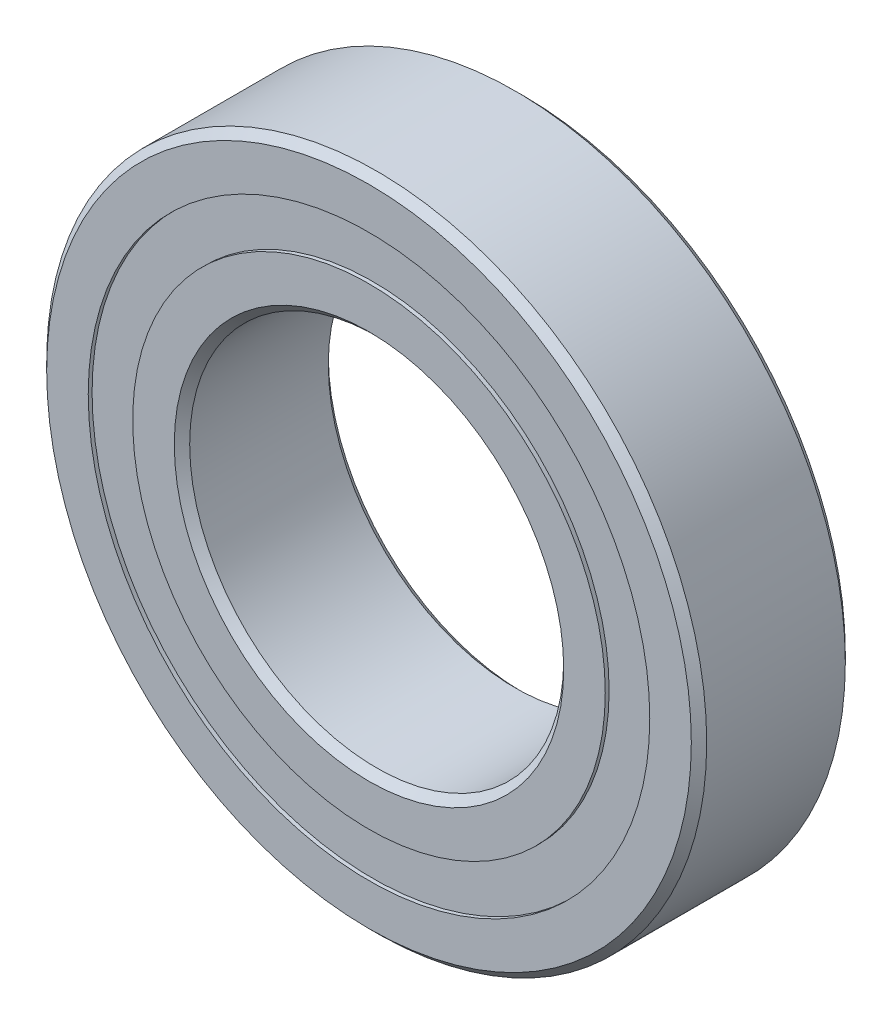
ISO-10303-21;
HEADER;
FILE_DESCRIPTION(('STEP AP214'),'2;1');
FILE_NAME('part.step','',(''),(''),'','','');
FILE_SCHEMA(('AUTOMOTIVE_DESIGN { 1 0 10303 214 1 1 1 1 }'));
ENDSEC;
DATA;
#1=APPLICATION_CONTEXT('core data for automotive mechanical design processes');
#2=APPLICATION_PROTOCOL_DEFINITION('international standard','automotive_design',2000,#1);
#3=PRODUCT_CONTEXT('',#1,'mechanical');
#4=PRODUCT('Part','Part','',(#3));
#5=PRODUCT_RELATED_PRODUCT_CATEGORY('part','',(#4));
#6=PRODUCT_DEFINITION_FORMATION('','',#4);
#7=PRODUCT_DEFINITION_CONTEXT('part definition',#1,'design');
#8=PRODUCT_DEFINITION('design','',#6,#7);
#9=PRODUCT_DEFINITION_SHAPE('','',#8);
#10=(LENGTH_UNIT() NAMED_UNIT(*) SI_UNIT(.MILLI.,.METRE.));
#11=(NAMED_UNIT(*) PLANE_ANGLE_UNIT() SI_UNIT($,.RADIAN.));
#12=(NAMED_UNIT(*) SI_UNIT($,.STERADIAN.) SOLID_ANGLE_UNIT());
#13=UNCERTAINTY_MEASURE_WITH_UNIT(LENGTH_MEASURE(1.E-05),#10,'distance_accuracy_value','');
#14=(GEOMETRIC_REPRESENTATION_CONTEXT(3) GLOBAL_UNCERTAINTY_ASSIGNED_CONTEXT((#13)) GLOBAL_UNIT_ASSIGNED_CONTEXT((#10,
#11,#12)) REPRESENTATION_CONTEXT('',''));
#15=CARTESIAN_POINT('',(0.,0.,0.));
#16=DIRECTION('',(0.,0.,1.));
#17=DIRECTION('',(1.,0.,0.));
#18=AXIS2_PLACEMENT_3D('',#15,#16,#17);
#19=CARTESIAN_POINT('',(-5.87499999999987,10.1757984944672,0.));
#20=DIRECTION('',(0.,0.,1.));
#21=DIRECTION('',(-0.499999999999989,0.866025403784445,0.));
#22=AXIS2_PLACEMENT_3D('',#19,#20,#21);
#23=SPHERICAL_SURFACE('',#22,1.85522286175012);
#24=CARTESIAN_POINT('',(-5.87499999999987,10.1757984944672,1.85522286175012));
#25=VERTEX_POINT('',#24);
#26=VERTEX_LOOP('',#25);
#27=FACE_BOUND('',#26,.T.);
#28=ADVANCED_FACE('F44',(#27),#23,.T.);
#29=CLOSED_SHELL('',(#28));
#30=MANIFOLD_SOLID_BREP('B2',#29);
#31=CARTESIAN_POINT('',(-10.1757984944671,5.87500000000012,0.));
#32=DIRECTION('',(0.,0.,1.));
#33=DIRECTION('',(-0.866025403784433,0.50000000000001,0.));
#34=AXIS2_PLACEMENT_3D('',#31,#32,#33);
#35=SPHERICAL_SURFACE('',#34,1.85522286175012);
#36=CARTESIAN_POINT('',(-10.1757984944671,5.87500000000012,1.85522286175012));
#37=VERTEX_POINT('',#36);
#38=VERTEX_LOOP('',#37);
#39=FACE_BOUND('',#38,.T.);
#40=ADVANCED_FACE('F67',(#39),#35,.T.);
#41=CLOSED_SHELL('',(#40));
#42=MANIFOLD_SOLID_BREP('B6',#41);
#43=CARTESIAN_POINT('',(-11.75,1.2307471719422E-13,0.));
#44=DIRECTION('',(0.,0.,1.));
#45=DIRECTION('',(-1.,0.,0.));
#46=AXIS2_PLACEMENT_3D('',#43,#44,#45);
#47=SPHERICAL_SURFACE('',#46,1.85522286175012);
#48=CARTESIAN_POINT('',(-11.75,1.2307471719422E-13,1.85522286175012));
#49=VERTEX_POINT('',#48);
#50=VERTEX_LOOP('',#49);
#51=FACE_BOUND('',#50,.T.);
#52=ADVANCED_FACE('F90',(#51),#47,.T.);
#53=CLOSED_SHELL('',(#52));
#54=MANIFOLD_SOLID_BREP('B40',#53);
#55=CARTESIAN_POINT('',(-10.1757984944672,-5.87499999999991,0.));
#56=DIRECTION('',(0.,0.,1.));
#57=DIRECTION('',(-0.866025403784443,-0.499999999999992,0.));
#58=AXIS2_PLACEMENT_3D('',#55,#56,#57);
#59=SPHERICAL_SURFACE('',#58,1.85522286175012);
#60=CARTESIAN_POINT('',(-10.1757984944672,-5.87499999999991,1.85522286175012));
#61=VERTEX_POINT('',#60);
#62=VERTEX_LOOP('',#61);
#63=FACE_BOUND('',#62,.T.);
#64=ADVANCED_FACE('F113',(#63),#59,.T.);
#65=CLOSED_SHELL('',(#64));
#66=MANIFOLD_SOLID_BREP('B63',#65);
#67=CARTESIAN_POINT('',(-5.87500000000009,-10.1757984944671,0.));
#68=DIRECTION('',(0.,0.,1.));
#69=DIRECTION('',(-0.500000000000007,-0.866025403784435,0.));
#70=AXIS2_PLACEMENT_3D('',#67,#68,#69);
#71=SPHERICAL_SURFACE('',#70,1.85522286175012);
#72=CARTESIAN_POINT('',(-5.87500000000009,-10.1757984944671,1.85522286175012));
#73=VERTEX_POINT('',#72);
#74=VERTEX_LOOP('',#73);
#75=FACE_BOUND('',#74,.T.);
#76=ADVANCED_FACE('F136',(#75),#71,.T.);
#77=CLOSED_SHELL('',(#76));
#78=MANIFOLD_SOLID_BREP('B86',#77);
#79=CARTESIAN_POINT('',(0.,-11.75,0.));
#80=DIRECTION('',(0.,0.,1.));
#81=DIRECTION('',(0.,-1.,0.));
#82=AXIS2_PLACEMENT_3D('',#79,#80,#81);
#83=SPHERICAL_SURFACE('',#82,1.85522286175012);
#84=CARTESIAN_POINT('',(0.,-11.75,1.85522286175012));
#85=VERTEX_POINT('',#84);
#86=VERTEX_LOOP('',#85);
#87=FACE_BOUND('',#86,.T.);
#88=ADVANCED_FACE('F159',(#87),#83,.T.);
#89=CLOSED_SHELL('',(#88));
#90=MANIFOLD_SOLID_BREP('B109',#89);
#91=CARTESIAN_POINT('',(5.87499999999994,-10.1757984944672,0.));
#92=DIRECTION('',(0.,0.,1.));
#93=DIRECTION('',(0.499999999999995,-0.866025403784442,0.));
#94=AXIS2_PLACEMENT_3D('',#91,#92,#93);
#95=SPHERICAL_SURFACE('',#94,1.85522286175012);
#96=CARTESIAN_POINT('',(5.87499999999994,-10.1757984944672,1.85522286175012));
#97=VERTEX_POINT('',#96);
#98=VERTEX_LOOP('',#97);
#99=FACE_BOUND('',#98,.T.);
#100=ADVANCED_FACE('F182',(#99),#95,.T.);
#101=CLOSED_SHELL('',(#100));
#102=MANIFOLD_SOLID_BREP('B132',#101);
#103=CARTESIAN_POINT('',(10.1757984944671,-5.87500000000005,0.));
#104=DIRECTION('',(0.,0.,1.));
#105=DIRECTION('',(0.866025403784436,-0.500000000000004,0.));
#106=AXIS2_PLACEMENT_3D('',#103,#104,#105);
#107=SPHERICAL_SURFACE('',#106,1.85522286175012);
#108=CARTESIAN_POINT('',(10.1757984944671,-5.87500000000005,1.85522286175012));
#109=VERTEX_POINT('',#108);
#110=VERTEX_LOOP('',#109);
#111=FACE_BOUND('',#110,.T.);
#112=ADVANCED_FACE('F205',(#111),#107,.T.);
#113=CLOSED_SHELL('',(#112));
#114=MANIFOLD_SOLID_BREP('B155',#113);
#115=CARTESIAN_POINT('',(11.75,0.,0.));
#116=DIRECTION('',(0.,0.,1.));
#117=DIRECTION('',(1.,0.,0.));
#118=AXIS2_PLACEMENT_3D('',#115,#116,#117);
#119=SPHERICAL_SURFACE('',#118,1.85522286175012);
#120=CARTESIAN_POINT('',(11.75,0.,1.85522286175012));
#121=VERTEX_POINT('',#120);
#122=VERTEX_LOOP('',#121);
#123=FACE_BOUND('',#122,.T.);
#124=ADVANCED_FACE('F228',(#123),#119,.T.);
#125=CLOSED_SHELL('',(#124));
#126=MANIFOLD_SOLID_BREP('B178',#125);
#127=CARTESIAN_POINT('',(10.1757984944672,5.87499999999998,0.));
#128=DIRECTION('',(0.,0.,1.));
#129=DIRECTION('',(0.86602540378444,0.499999999999998,0.));
#130=AXIS2_PLACEMENT_3D('',#127,#128,#129);
#131=SPHERICAL_SURFACE('',#130,1.85522286175012);
#132=CARTESIAN_POINT('',(10.1757984944672,5.87499999999998,1.85522286175012));
#133=VERTEX_POINT('',#132);
#134=VERTEX_LOOP('',#133);
#135=FACE_BOUND('',#134,.T.);
#136=ADVANCED_FACE('F251',(#135),#131,.T.);
#137=CLOSED_SHELL('',(#136));
#138=MANIFOLD_SOLID_BREP('B201',#137);
#139=CARTESIAN_POINT('',(5.87500000000001,10.1757984944671,0.));
#140=DIRECTION('',(0.,0.,1.));
#141=DIRECTION('',(0.500000000000001,0.866025403784438,0.));
#142=AXIS2_PLACEMENT_3D('',#139,#140,#141);
#143=SPHERICAL_SURFACE('',#142,1.85522286175012);
#144=CARTESIAN_POINT('',(5.87500000000001,10.1757984944671,1.85522286175012));
#145=VERTEX_POINT('',#144);
#146=VERTEX_LOOP('',#145);
#147=FACE_BOUND('',#146,.T.);
#148=ADVANCED_FACE('F274',(#147),#143,.T.);
#149=CLOSED_SHELL('',(#148));
#150=MANIFOLD_SOLID_BREP('B224',#149);
#151=CARTESIAN_POINT('',(0.,11.75,0.));
#152=DIRECTION('',(0.,0.,1.));
#153=DIRECTION('',(0.,1.,0.));
#154=AXIS2_PLACEMENT_3D('',#151,#152,#153);
#155=SPHERICAL_SURFACE('',#154,1.85522286175012);
#156=CARTESIAN_POINT('',(0.,11.75,1.85522286175012));
#157=VERTEX_POINT('',#156);
#158=VERTEX_LOOP('',#157);
#159=FACE_BOUND('',#158,.T.);
#160=ADVANCED_FACE('F298',(#159),#155,.T.);
#161=CLOSED_SHELL('',(#160));
#162=MANIFOLD_SOLID_BREP('B247',#161);
#163=CARTESIAN_POINT('',(0.,0.,3.5));
#164=DIRECTION('',(0.,0.,1.));
#165=DIRECTION('',(1.,0.,0.));
#166=AXIS2_PLACEMENT_3D('',#163,#164,#165);
#167=CYLINDRICAL_SURFACE('',#166,12.760989010989);
#168=CARTESIAN_POINT('',(0.,0.,-3.5));
#169=DIRECTION('',(0.,0.,1.));
#170=DIRECTION('',(1.,0.,0.));
#171=AXIS2_PLACEMENT_3D('',#168,#169,#170);
#172=CIRCLE('',#171,12.760989010989);
#173=CARTESIAN_POINT('',(12.760989010989,0.,-3.5));
#174=VERTEX_POINT('',#173);
#175=EDGE_CURVE('E353',#174,#174,#172,.T.);
#176=ORIENTED_EDGE('',*,*,#175,.F.);
#177=EDGE_LOOP('',(#176));
#178=FACE_BOUND('',#177,.T.);
#179=CARTESIAN_POINT('',(0.,0.,-3.32500000000001));
#180=DIRECTION('',(0.,0.,1.));
#181=DIRECTION('',(1.,0.,0.));
#182=AXIS2_PLACEMENT_3D('',#179,#180,#181);
#183=CIRCLE('',#182,12.760989010989);
#184=CARTESIAN_POINT('',(12.760989010989,0.,-3.32500000000001));
#185=VERTEX_POINT('',#184);
#186=EDGE_CURVE('E297',#185,#185,#183,.F.);
#187=ORIENTED_EDGE('',*,*,#186,.F.);
#188=EDGE_LOOP('',(#187));
#189=FACE_BOUND('',#188,.T.);
#190=ADVANCED_FACE('F314',(#178,#189),#167,.F.);
#191=CARTESIAN_POINT('',(0.,0.,3.5));
#192=DIRECTION('',(0.,0.,1.));
#193=DIRECTION('',(1.,0.,0.));
#194=AXIS2_PLACEMENT_3D('',#191,#192,#193);
#195=CYLINDRICAL_SURFACE('',#194,10.739010989011);
#196=CARTESIAN_POINT('',(0.,0.,-3.5));
#197=DIRECTION('',(0.,0.,1.));
#198=DIRECTION('',(1.,0.,0.));
#199=AXIS2_PLACEMENT_3D('',#196,#197,#198);
#200=CIRCLE('',#199,10.739010989011);
#201=CARTESIAN_POINT('',(10.739010989011,0.,-3.5));
#202=VERTEX_POINT('',#201);
#203=EDGE_CURVE('E380',#202,#202,#200,.T.);
#204=ORIENTED_EDGE('',*,*,#203,.T.);
#205=EDGE_LOOP('',(#204));
#206=FACE_BOUND('',#205,.T.);
#207=CARTESIAN_POINT('',(0.,0.,-3.32500000000001));
#208=DIRECTION('',(0.,0.,1.));
#209=DIRECTION('',(1.,0.,0.));
#210=AXIS2_PLACEMENT_3D('',#207,#208,#209);
#211=CIRCLE('',#210,10.739010989011);
#212=CARTESIAN_POINT('',(10.739010989011,0.,-3.32500000000001));
#213=VERTEX_POINT('',#212);
#214=EDGE_CURVE('E326',#213,#213,#211,.T.);
#215=ORIENTED_EDGE('',*,*,#214,.F.);
#216=EDGE_LOOP('',(#215));
#217=FACE_BOUND('',#216,.T.);
#218=ADVANCED_FACE('F422',(#206,#217),#195,.T.);
#219=CARTESIAN_POINT('',(0.,0.,3.5));
#220=DIRECTION('',(0.,0.,1.));
#221=DIRECTION('',(1.,0.,0.));
#222=AXIS2_PLACEMENT_3D('',#219,#220,#221);
#223=CYLINDRICAL_SURFACE('',#222,12.760989010989);
#224=CARTESIAN_POINT('',(0.,0.,3.5));
#225=DIRECTION('',(0.,0.,1.));
#226=DIRECTION('',(1.,0.,0.));
#227=AXIS2_PLACEMENT_3D('',#224,#225,#226);
#228=CIRCLE('',#227,12.760989010989);
#229=CARTESIAN_POINT('',(12.760989010989,0.,3.5));
#230=VERTEX_POINT('',#229);
#231=EDGE_CURVE('E344',#230,#230,#228,.T.);
#232=ORIENTED_EDGE('',*,*,#231,.T.);
#233=EDGE_LOOP('',(#232));
#234=FACE_BOUND('',#233,.T.);
#235=CARTESIAN_POINT('',(0.,0.,3.32500000000001));
#236=DIRECTION('',(0.,0.,-1.));
#237=DIRECTION('',(-1.,0.,0.));
#238=AXIS2_PLACEMENT_3D('',#235,#236,#237);
#239=CIRCLE('',#238,12.760989010989);
#240=CARTESIAN_POINT('',(-12.760989010989,0.,3.32500000000001));
#241=VERTEX_POINT('',#240);
#242=EDGE_CURVE('E335',#241,#241,#239,.F.);
#243=ORIENTED_EDGE('',*,*,#242,.F.);
#244=EDGE_LOOP('',(#243));
#245=FACE_BOUND('',#244,.T.);
#246=ADVANCED_FACE('F420',(#234,#245),#223,.F.);
#247=CARTESIAN_POINT('',(0.,0.,3.15));
#248=DIRECTION('',(0.,0.,-1.));
#249=DIRECTION('',(-1.,0.,0.));
#250=AXIS2_PLACEMENT_3D('',#247,#248,#249);
#251=CONICAL_SURFACE('',#250,15.,0.78539816339745);
#252=CARTESIAN_POINT('',(0.,0.,3.5));
#253=DIRECTION('',(0.,0.,1.));
#254=DIRECTION('',(1.,0.,0.));
#255=AXIS2_PLACEMENT_3D('',#252,#253,#254);
#256=CIRCLE('',#255,14.65);
#257=CARTESIAN_POINT('',(14.65,0.,3.5));
#258=VERTEX_POINT('',#257);
#259=EDGE_CURVE('E341',#258,#258,#256,.T.);
#260=ORIENTED_EDGE('',*,*,#259,.F.);
#261=EDGE_LOOP('',(#260));
#262=FACE_BOUND('',#261,.T.);
#263=CARTESIAN_POINT('',(0.,0.,3.15));
#264=DIRECTION('',(0.,0.,1.));
#265=DIRECTION('',(1.,0.,0.));
#266=AXIS2_PLACEMENT_3D('',#263,#264,#265);
#267=CIRCLE('',#266,15.);
#268=CARTESIAN_POINT('',(15.,0.,3.15));
#269=VERTEX_POINT('',#268);
#270=EDGE_CURVE('E362',#269,#269,#267,.T.);
#271=ORIENTED_EDGE('',*,*,#270,.T.);
#272=EDGE_LOOP('',(#271));
#273=FACE_BOUND('',#272,.T.);
#274=ADVANCED_FACE('F316',(#262,#273),#251,.T.);
#275=CARTESIAN_POINT('',(0.,14.65,3.5));
#276=DIRECTION('',(0.,0.,-1.));
#277=DIRECTION('',(-1.,0.,0.));
#278=AXIS2_PLACEMENT_3D('',#275,#276,#277);
#279=PLANE('',#278);
#280=ORIENTED_EDGE('',*,*,#231,.F.);
#281=EDGE_LOOP('',(#280));
#282=FACE_BOUND('',#281,.T.);
#283=ORIENTED_EDGE('',*,*,#259,.T.);
#284=EDGE_LOOP('',(#283));
#285=FACE_BOUND('',#284,.T.);
#286=ADVANCED_FACE('F430',(#282,#285),#279,.F.);
#287=CARTESIAN_POINT('',(0.,14.65,-3.5));
#288=DIRECTION('',(0.,0.,1.));
#289=DIRECTION('',(1.,0.,0.));
#290=AXIS2_PLACEMENT_3D('',#287,#288,#289);
#291=PLANE('',#290);
#292=CARTESIAN_POINT('',(0.,0.,-3.5));
#293=DIRECTION('',(0.,0.,1.));
#294=DIRECTION('',(1.,0.,0.));
#295=AXIS2_PLACEMENT_3D('',#292,#293,#294);
#296=CIRCLE('',#295,14.65);
#297=CARTESIAN_POINT('',(14.65,0.,-3.5));
#298=VERTEX_POINT('',#297);
#299=EDGE_CURVE('E356',#298,#298,#296,.T.);
#300=ORIENTED_EDGE('',*,*,#299,.F.);
#301=EDGE_LOOP('',(#300));
#302=FACE_BOUND('',#301,.T.);
#303=ORIENTED_EDGE('',*,*,#175,.T.);
#304=EDGE_LOOP('',(#303));
#305=FACE_BOUND('',#304,.T.);
#306=ADVANCED_FACE('F492',(#302,#305),#291,.F.);
#307=CARTESIAN_POINT('',(0.,0.,-3.5));
#308=DIRECTION('',(0.,0.,1.));
#309=DIRECTION('',(1.,0.,0.));
#310=AXIS2_PLACEMENT_3D('',#307,#308,#309);
#311=CONICAL_SURFACE('',#310,14.65,0.78539816339745);
#312=CARTESIAN_POINT('',(0.,0.,-3.15));
#313=DIRECTION('',(0.,0.,1.));
#314=DIRECTION('',(1.,0.,0.));
#315=AXIS2_PLACEMENT_3D('',#312,#313,#314);
#316=CIRCLE('',#315,15.);
#317=CARTESIAN_POINT('',(15.,0.,-3.15));
#318=VERTEX_POINT('',#317);
#319=EDGE_CURVE('E359',#318,#318,#316,.T.);
#320=ORIENTED_EDGE('',*,*,#319,.F.);
#321=EDGE_LOOP('',(#320));
#322=FACE_BOUND('',#321,.T.);
#323=ORIENTED_EDGE('',*,*,#299,.T.);
#324=EDGE_LOOP('',(#323));
#325=FACE_BOUND('',#324,.T.);
#326=ADVANCED_FACE('F489',(#322,#325),#311,.T.);
#327=CARTESIAN_POINT('',(0.,0.,3.5));
#328=DIRECTION('',(0.,0.,1.));
#329=DIRECTION('',(1.,0.,0.));
#330=AXIS2_PLACEMENT_3D('',#327,#328,#329);
#331=CYLINDRICAL_SURFACE('',#330,15.);
#332=ORIENTED_EDGE('',*,*,#270,.F.);
#333=EDGE_LOOP('',(#332));
#334=FACE_BOUND('',#333,.T.);
#335=ORIENTED_EDGE('',*,*,#319,.T.);
#336=EDGE_LOOP('',(#335));
#337=FACE_BOUND('',#336,.T.);
#338=ADVANCED_FACE('F416',(#334,#337),#331,.T.);
#339=CARTESIAN_POINT('',(0.,12.760989010989,3.32500000000001));
#340=DIRECTION('',(0.,0.,-1.));
#341=DIRECTION('',(-1.,0.,0.));
#342=AXIS2_PLACEMENT_3D('',#339,#340,#341);
#343=PLANE('',#342);
#344=CARTESIAN_POINT('',(0.,0.,3.32500000000001));
#345=DIRECTION('',(0.,0.,1.));
#346=DIRECTION('',(1.,0.,0.));
#347=AXIS2_PLACEMENT_3D('',#344,#345,#346);
#348=CIRCLE('',#347,10.739010989011);
#349=CARTESIAN_POINT('',(10.739010989011,0.,3.32500000000001));
#350=VERTEX_POINT('',#349);
#351=EDGE_CURVE('E365',#350,#350,#348,.T.);
#352=ORIENTED_EDGE('',*,*,#351,.F.);
#353=EDGE_LOOP('',(#352));
#354=FACE_BOUND('',#353,.T.);
#355=ORIENTED_EDGE('',*,*,#242,.T.);
#356=EDGE_LOOP('',(#355));
#357=FACE_BOUND('',#356,.T.);
#358=ADVANCED_FACE('F409',(#354,#357),#343,.F.);
#359=CARTESIAN_POINT('',(0.,0.,3.5));
#360=DIRECTION('',(0.,0.,1.));
#361=DIRECTION('',(1.,0.,0.));
#362=AXIS2_PLACEMENT_3D('',#359,#360,#361);
#363=CYLINDRICAL_SURFACE('',#362,10.739010989011);
#364=CARTESIAN_POINT('',(0.,0.,3.5));
#365=DIRECTION('',(0.,0.,1.));
#366=DIRECTION('',(1.,0.,0.));
#367=AXIS2_PLACEMENT_3D('',#364,#365,#366);
#368=CIRCLE('',#367,10.739010989011);
#369=CARTESIAN_POINT('',(10.739010989011,0.,3.5));
#370=VERTEX_POINT('',#369);
#371=EDGE_CURVE('E389',#370,#370,#368,.T.);
#372=ORIENTED_EDGE('',*,*,#371,.F.);
#373=EDGE_LOOP('',(#372));
#374=FACE_BOUND('',#373,.T.);
#375=ORIENTED_EDGE('',*,*,#351,.T.);
#376=EDGE_LOOP('',(#375));
#377=FACE_BOUND('',#376,.T.);
#378=ADVANCED_FACE('F406',(#374,#377),#363,.T.);
#379=CARTESIAN_POINT('',(0.,0.,3.5));
#380=DIRECTION('',(0.,0.,1.));
#381=DIRECTION('',(1.,0.,0.));
#382=AXIS2_PLACEMENT_3D('',#379,#380,#381);
#383=CONICAL_SURFACE('',#382,8.85000000000001,0.785398163397452);
#384=CARTESIAN_POINT('',(0.,0.,3.15));
#385=DIRECTION('',(0.,0.,1.));
#386=DIRECTION('',(1.,0.,0.));
#387=AXIS2_PLACEMENT_3D('',#384,#385,#386);
#388=CIRCLE('',#387,8.50000000000001);
#389=CARTESIAN_POINT('',(8.50000000000001,0.,3.15));
#390=VERTEX_POINT('',#389);
#391=EDGE_CURVE('E371',#390,#390,#388,.T.);
#392=ORIENTED_EDGE('',*,*,#391,.F.);
#393=EDGE_LOOP('',(#392));
#394=FACE_BOUND('',#393,.T.);
#395=CARTESIAN_POINT('',(0.,0.,3.5));
#396=DIRECTION('',(0.,0.,1.));
#397=DIRECTION('',(1.,0.,0.));
#398=AXIS2_PLACEMENT_3D('',#395,#396,#397);
#399=CIRCLE('',#398,8.85000000000001);
#400=CARTESIAN_POINT('',(8.85000000000001,0.,3.5));
#401=VERTEX_POINT('',#400);
#402=EDGE_CURVE('E392',#401,#401,#399,.T.);
#403=ORIENTED_EDGE('',*,*,#402,.T.);
#404=EDGE_LOOP('',(#403));
#405=FACE_BOUND('',#404,.T.);
#406=ADVANCED_FACE('F396',(#394,#405),#383,.F.);
#407=CARTESIAN_POINT('',(0.,0.,3.5));
#408=DIRECTION('',(0.,0.,1.));
#409=DIRECTION('',(1.,0.,0.));
#410=AXIS2_PLACEMENT_3D('',#407,#408,#409);
#411=CYLINDRICAL_SURFACE('',#410,8.50000000000001);
#412=CARTESIAN_POINT('',(0.,0.,-3.15));
#413=DIRECTION('',(0.,0.,1.));
#414=DIRECTION('',(1.,0.,0.));
#415=AXIS2_PLACEMENT_3D('',#412,#413,#414);
#416=CIRCLE('',#415,8.50000000000001);
#417=CARTESIAN_POINT('',(8.50000000000001,0.,-3.15));
#418=VERTEX_POINT('',#417);
#419=EDGE_CURVE('E374',#418,#418,#416,.T.);
#420=ORIENTED_EDGE('',*,*,#419,.F.);
#421=EDGE_LOOP('',(#420));
#422=FACE_BOUND('',#421,.T.);
#423=ORIENTED_EDGE('',*,*,#391,.T.);
#424=EDGE_LOOP('',(#423));
#425=FACE_BOUND('',#424,.T.);
#426=ADVANCED_FACE('F479',(#422,#425),#411,.F.);
#427=CARTESIAN_POINT('',(0.,0.,-3.15));
#428=DIRECTION('',(0.,0.,-1.));
#429=DIRECTION('',(-1.,0.,0.));
#430=AXIS2_PLACEMENT_3D('',#427,#428,#429);
#431=CONICAL_SURFACE('',#430,8.50000000000001,0.785398163397452);
#432=CARTESIAN_POINT('',(0.,0.,-3.5));
#433=DIRECTION('',(0.,0.,1.));
#434=DIRECTION('',(1.,0.,0.));
#435=AXIS2_PLACEMENT_3D('',#432,#433,#434);
#436=CIRCLE('',#435,8.85000000000001);
#437=CARTESIAN_POINT('',(8.85000000000001,0.,-3.5));
#438=VERTEX_POINT('',#437);
#439=EDGE_CURVE('E377',#438,#438,#436,.T.);
#440=ORIENTED_EDGE('',*,*,#439,.F.);
#441=EDGE_LOOP('',(#440));
#442=FACE_BOUND('',#441,.T.);
#443=ORIENTED_EDGE('',*,*,#419,.T.);
#444=EDGE_LOOP('',(#443));
#445=FACE_BOUND('',#444,.T.);
#446=ADVANCED_FACE('F475',(#442,#445),#431,.F.);
#447=CARTESIAN_POINT('',(0.,8.85000000000001,-3.5));
#448=DIRECTION('',(0.,0.,1.));
#449=DIRECTION('',(1.,0.,0.));
#450=AXIS2_PLACEMENT_3D('',#447,#448,#449);
#451=PLANE('',#450);
#452=ORIENTED_EDGE('',*,*,#203,.F.);
#453=EDGE_LOOP('',(#452));
#454=FACE_BOUND('',#453,.T.);
#455=ORIENTED_EDGE('',*,*,#439,.T.);
#456=EDGE_LOOP('',(#455));
#457=FACE_BOUND('',#456,.T.);
#458=ADVANCED_FACE('F402',(#454,#457),#451,.F.);
#459=CARTESIAN_POINT('',(0.,8.85000000000001,3.5));
#460=DIRECTION('',(0.,0.,-1.));
#461=DIRECTION('',(-1.,0.,0.));
#462=AXIS2_PLACEMENT_3D('',#459,#460,#461);
#463=PLANE('',#462);
#464=ORIENTED_EDGE('',*,*,#402,.F.);
#465=EDGE_LOOP('',(#464));
#466=FACE_BOUND('',#465,.T.);
#467=ORIENTED_EDGE('',*,*,#371,.T.);
#468=EDGE_LOOP('',(#467));
#469=FACE_BOUND('',#468,.T.);
#470=ADVANCED_FACE('F398',(#466,#469),#463,.F.);
#471=CARTESIAN_POINT('',(0.,12.760989010989,-3.32500000000001));
#472=DIRECTION('',(0.,0.,1.));
#473=DIRECTION('',(1.,0.,0.));
#474=AXIS2_PLACEMENT_3D('',#471,#472,#473);
#475=PLANE('',#474);
#476=ORIENTED_EDGE('',*,*,#186,.T.);
#477=EDGE_LOOP('',(#476));
#478=FACE_BOUND('',#477,.T.);
#479=ORIENTED_EDGE('',*,*,#214,.T.);
#480=EDGE_LOOP('',(#479));
#481=FACE_BOUND('',#480,.T.);
#482=ADVANCED_FACE('F401',(#478,#481),#475,.F.);
#483=CLOSED_SHELL('',(#190,#218,#246,#274,#286,#306,#326,#338,#358,#378,#406,#426,#446,#458,
#470,#482));
#484=CARTESIAN_POINT('',(0.,12.760989010989,-1.85522286175012));
#485=DIRECTION('',(0.,0.,-1.));
#486=DIRECTION('',(-1.,0.,0.));
#487=AXIS2_PLACEMENT_3D('',#484,#485,#486);
#488=PLANE('',#487);
#489=CARTESIAN_POINT('',(0.,0.,-1.85522286175012));
#490=DIRECTION('',(0.,0.,-1.));
#491=DIRECTION('',(-1.,0.,0.));
#492=AXIS2_PLACEMENT_3D('',#489,#490,#491);
#493=CIRCLE('',#492,10.739010989011);
#494=CARTESIAN_POINT('',(-10.739010989011,0.,-1.85522286175012));
#495=VERTEX_POINT('',#494);
#496=EDGE_CURVE('E330',#495,#495,#493,.T.);
#497=ORIENTED_EDGE('',*,*,#496,.T.);
#498=EDGE_LOOP('',(#497));
#499=FACE_BOUND('',#498,.T.);
#500=CARTESIAN_POINT('',(0.,0.,-1.85522286175012));
#501=DIRECTION('',(0.,0.,-1.));
#502=DIRECTION('',(-1.,0.,0.));
#503=AXIS2_PLACEMENT_3D('',#500,#501,#502);
#504=CIRCLE('',#503,12.760989010989);
#505=CARTESIAN_POINT('',(-12.760989010989,0.,-1.85522286175012));
#506=VERTEX_POINT('',#505);
#507=EDGE_CURVE('E322',#506,#506,#504,.F.);
#508=ORIENTED_EDGE('',*,*,#507,.T.);
#509=EDGE_LOOP('',(#508));
#510=FACE_BOUND('',#509,.T.);
#511=ADVANCED_FACE('F438',(#499,#510),#488,.F.);
#512=CARTESIAN_POINT('',(0.,0.,1.55555555555556));
#513=DIRECTION('',(0.,0.,1.));
#514=DIRECTION('',(1.,0.,0.));
#515=AXIS2_PLACEMENT_3D('',#512,#513,#514);
#516=CIRCLE('',#515,12.760989010989);
#517=CARTESIAN_POINT('',(12.760989010989,0.,1.55555555555556));
#518=VERTEX_POINT('',#517);
#519=EDGE_CURVE('E347',#518,#518,#516,.T.);
#520=ORIENTED_EDGE('',*,*,#519,.F.);
#521=EDGE_LOOP('',(#520));
#522=FACE_BOUND('',#521,.T.);
#523=CARTESIAN_POINT('',(0.,0.,1.85522286175012));
#524=DIRECTION('',(0.,0.,1.));
#525=DIRECTION('',(1.,0.,0.));
#526=AXIS2_PLACEMENT_3D('',#523,#524,#525);
#527=CIRCLE('',#526,12.760989010989);
#528=CARTESIAN_POINT('',(12.760989010989,0.,1.85522286175012));
#529=VERTEX_POINT('',#528);
#530=EDGE_CURVE('E338',#529,#529,#527,.F.);
#531=ORIENTED_EDGE('',*,*,#530,.F.);
#532=EDGE_LOOP('',(#531));
#533=FACE_BOUND('',#532,.T.);
#534=ADVANCED_FACE('F425',(#522,#533),#223,.F.);
#535=CARTESIAN_POINT('',(0.,0.,0.));
#536=DIRECTION('',(0.,0.,1.));
#537=DIRECTION('',(1.,0.,0.));
#538=AXIS2_PLACEMENT_3D('',#535,#536,#537);
#539=TOROIDAL_SURFACE('',#538,11.75,1.85522286175012);
#540=CARTESIAN_POINT('',(0.,0.,-1.55555555555556));
#541=DIRECTION('',(0.,0.,1.));
#542=DIRECTION('',(1.,0.,0.));
#543=AXIS2_PLACEMENT_3D('',#540,#541,#542);
#544=CIRCLE('',#543,12.760989010989);
#545=CARTESIAN_POINT('',(12.760989010989,0.,-1.55555555555556));
#546=VERTEX_POINT('',#545);
#547=EDGE_CURVE('E350',#546,#546,#544,.T.);
#548=ORIENTED_EDGE('',*,*,#547,.F.);
#549=EDGE_LOOP('',(#548));
#550=FACE_BOUND('',#549,.T.);
#551=ORIENTED_EDGE('',*,*,#519,.T.);
#552=EDGE_LOOP('',(#551));
#553=FACE_BOUND('',#552,.T.);
#554=ADVANCED_FACE('F437',(#550,#553),#539,.F.);
#555=ORIENTED_EDGE('',*,*,#547,.T.);
#556=EDGE_LOOP('',(#555));
#557=FACE_BOUND('',#556,.T.);
#558=ORIENTED_EDGE('',*,*,#507,.F.);
#559=EDGE_LOOP('',(#558));
#560=FACE_BOUND('',#559,.T.);
#561=ADVANCED_FACE('F444',(#557,#560),#167,.F.);
#562=CARTESIAN_POINT('',(0.,12.760989010989,1.85522286175012));
#563=DIRECTION('',(0.,0.,1.));
#564=DIRECTION('',(1.,0.,0.));
#565=AXIS2_PLACEMENT_3D('',#562,#563,#564);
#566=PLANE('',#565);
#567=ORIENTED_EDGE('',*,*,#530,.T.);
#568=EDGE_LOOP('',(#567));
#569=FACE_BOUND('',#568,.T.);
#570=CARTESIAN_POINT('',(0.,0.,1.85522286175012));
#571=DIRECTION('',(0.,0.,1.));
#572=DIRECTION('',(1.,0.,0.));
#573=AXIS2_PLACEMENT_3D('',#570,#571,#572);
#574=CIRCLE('',#573,10.739010989011);
#575=CARTESIAN_POINT('',(10.739010989011,0.,1.85522286175012));
#576=VERTEX_POINT('',#575);
#577=EDGE_CURVE('E368',#576,#576,#574,.F.);
#578=ORIENTED_EDGE('',*,*,#577,.F.);
#579=EDGE_LOOP('',(#578));
#580=FACE_BOUND('',#579,.T.);
#581=ADVANCED_FACE('F451',(#569,#580),#566,.F.);
#582=CARTESIAN_POINT('',(0.,0.,1.55555555555556));
#583=DIRECTION('',(0.,0.,1.));
#584=DIRECTION('',(1.,0.,0.));
#585=AXIS2_PLACEMENT_3D('',#582,#583,#584);
#586=CIRCLE('',#585,10.739010989011);
#587=CARTESIAN_POINT('',(10.739010989011,0.,1.55555555555556));
#588=VERTEX_POINT('',#587);
#589=EDGE_CURVE('E386',#588,#588,#586,.T.);
#590=ORIENTED_EDGE('',*,*,#589,.T.);
#591=EDGE_LOOP('',(#590));
#592=FACE_BOUND('',#591,.T.);
#593=ORIENTED_EDGE('',*,*,#577,.T.);
#594=EDGE_LOOP('',(#593));
#595=FACE_BOUND('',#594,.T.);
#596=ADVANCED_FACE('F411',(#592,#595),#363,.T.);
#597=CARTESIAN_POINT('',(0.,0.,0.));
#598=DIRECTION('',(0.,0.,1.));
#599=DIRECTION('',(1.,0.,0.));
#600=AXIS2_PLACEMENT_3D('',#597,#598,#599);
#601=TOROIDAL_SURFACE('',#600,11.75,1.85522286175012);
#602=ORIENTED_EDGE('',*,*,#589,.F.);
#603=EDGE_LOOP('',(#602));
#604=FACE_BOUND('',#603,.T.);
#605=CARTESIAN_POINT('',(0.,0.,-1.55555555555556));
#606=DIRECTION('',(0.,0.,1.));
#607=DIRECTION('',(1.,0.,0.));
#608=AXIS2_PLACEMENT_3D('',#605,#606,#607);
#609=CIRCLE('',#608,10.739010989011);
#610=CARTESIAN_POINT('',(10.739010989011,0.,-1.55555555555556));
#611=VERTEX_POINT('',#610);
#612=EDGE_CURVE('E383',#611,#611,#609,.T.);
#613=ORIENTED_EDGE('',*,*,#612,.T.);
#614=EDGE_LOOP('',(#613));
#615=FACE_BOUND('',#614,.T.);
#616=ADVANCED_FACE('F469',(#604,#615),#601,.F.);
#617=ORIENTED_EDGE('',*,*,#612,.F.);
#618=EDGE_LOOP('',(#617));
#619=FACE_BOUND('',#618,.T.);
#620=ORIENTED_EDGE('',*,*,#496,.F.);
#621=EDGE_LOOP('',(#620));
#622=FACE_BOUND('',#621,.T.);
#623=ADVANCED_FACE('F434',(#619,#622),#195,.T.);
#624=CLOSED_SHELL('',(#511,#534,#554,#561,#581,#596,#616,#623));
#625=ORIENTED_CLOSED_SHELL('',*,#624,.T.);
#626=BREP_WITH_VOIDS('B270',#483,(#625));
#627=ADVANCED_BREP_SHAPE_REPRESENTATION('',(#18,#30,#42,#54,#66,#78,#90,#102,#114,#126,#138,
#150,#162,#626),#14);
#628=SHAPE_DEFINITION_REPRESENTATION(#9,#627);
ENDSEC;
END-ISO-10303-21;
